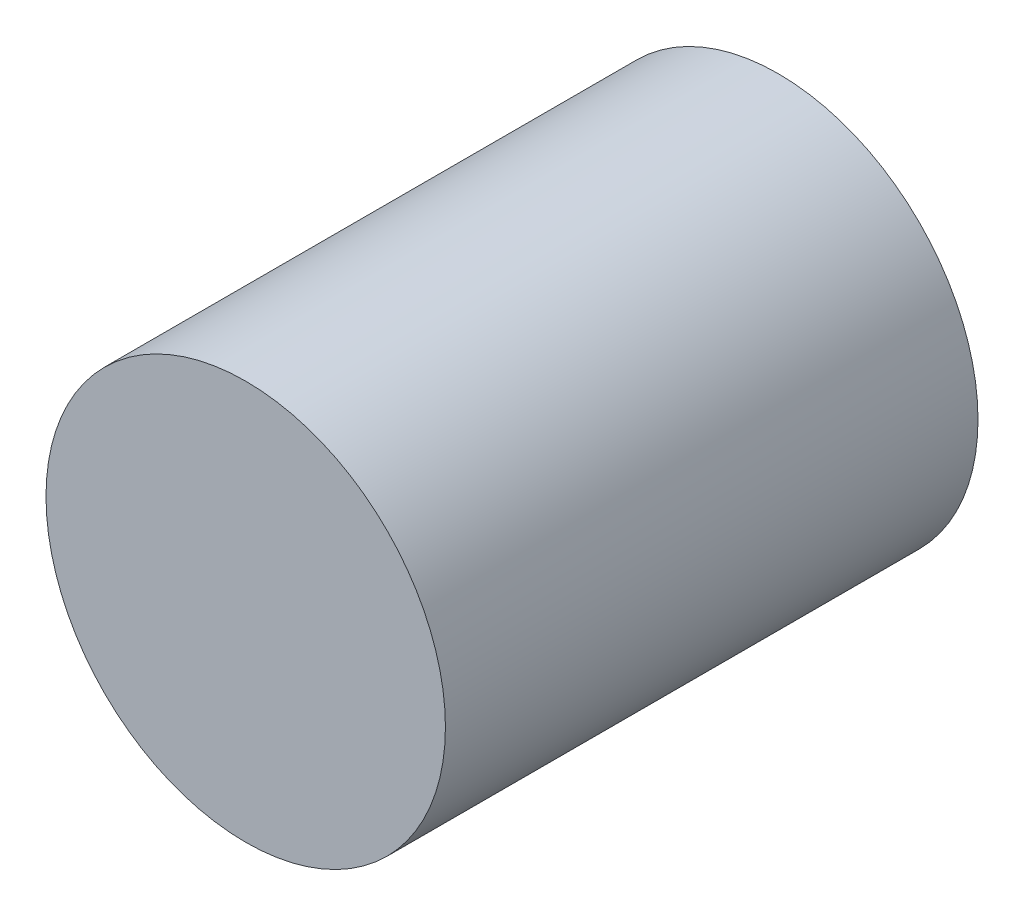
ISO-10303-21;
HEADER;
FILE_DESCRIPTION(('STEP AP214'),'2;1');
FILE_NAME('part.step','',(''),(''),'','','');
FILE_SCHEMA(('AUTOMOTIVE_DESIGN { 1 0 10303 214 1 1 1 1 }'));
ENDSEC;
DATA;
#1=APPLICATION_CONTEXT('core data for automotive mechanical design processes');
#2=APPLICATION_PROTOCOL_DEFINITION('international standard','automotive_design',2000,#1);
#3=PRODUCT_CONTEXT('',#1,'mechanical');
#4=PRODUCT('Part','Part','',(#3));
#5=PRODUCT_RELATED_PRODUCT_CATEGORY('part','',(#4));
#6=PRODUCT_DEFINITION_FORMATION('','',#4);
#7=PRODUCT_DEFINITION_CONTEXT('part definition',#1,'design');
#8=PRODUCT_DEFINITION('design','',#6,#7);
#9=PRODUCT_DEFINITION_SHAPE('','',#8);
#10=(LENGTH_UNIT() NAMED_UNIT(*) SI_UNIT(.MILLI.,.METRE.));
#11=(NAMED_UNIT(*) PLANE_ANGLE_UNIT() SI_UNIT($,.RADIAN.));
#12=(NAMED_UNIT(*) SI_UNIT($,.STERADIAN.) SOLID_ANGLE_UNIT());
#13=UNCERTAINTY_MEASURE_WITH_UNIT(LENGTH_MEASURE(1.E-05),#10,'distance_accuracy_value','');
#14=(GEOMETRIC_REPRESENTATION_CONTEXT(3) GLOBAL_UNCERTAINTY_ASSIGNED_CONTEXT((#13)) GLOBAL_UNIT_ASSIGNED_CONTEXT((#10,
#11,#12)) REPRESENTATION_CONTEXT('',''));
#15=CARTESIAN_POINT('',(0.,0.,0.));
#16=DIRECTION('',(0.,0.,1.));
#17=DIRECTION('',(1.,0.,0.));
#18=AXIS2_PLACEMENT_3D('',#15,#16,#17);
#19=CARTESIAN_POINT('',(0.,0.,12.7));
#20=DIRECTION('',(0.,0.,-1.));
#21=DIRECTION('',(-1.,0.,0.));
#22=AXIS2_PLACEMENT_3D('',#19,#20,#21);
#23=CYLINDRICAL_SURFACE('',#22,4.7625);
#24=CARTESIAN_POINT('',(0.,0.,12.7));
#25=DIRECTION('',(0.,0.,1.));
#26=DIRECTION('',(1.,0.,0.));
#27=AXIS2_PLACEMENT_3D('',#24,#25,#26);
#28=CIRCLE('',#27,4.7625);
#29=CARTESIAN_POINT('',(4.7625,0.,12.7));
#30=VERTEX_POINT('',#29);
#31=EDGE_CURVE('E10',#30,#30,#28,.T.);
#32=ORIENTED_EDGE('',*,*,#31,.F.);
#33=EDGE_LOOP('',(#32));
#34=FACE_BOUND('',#33,.T.);
#35=CARTESIAN_POINT('',(0.,0.,0.));
#36=DIRECTION('',(0.,0.,1.));
#37=DIRECTION('',(1.,0.,0.));
#38=AXIS2_PLACEMENT_3D('',#35,#36,#37);
#39=CIRCLE('',#38,4.7625);
#40=CARTESIAN_POINT('',(4.7625,0.,0.));
#41=VERTEX_POINT('',#40);
#42=EDGE_CURVE('E40',#41,#41,#39,.T.);
#43=ORIENTED_EDGE('',*,*,#42,.T.);
#44=EDGE_LOOP('',(#43));
#45=FACE_BOUND('',#44,.T.);
#46=ADVANCED_FACE('F34',(#34,#45),#23,.T.);
#47=CARTESIAN_POINT('',(0.,0.,12.7));
#48=DIRECTION('',(0.,0.,1.));
#49=DIRECTION('',(1.,0.,0.));
#50=AXIS2_PLACEMENT_3D('',#47,#48,#49);
#51=PLANE('',#50);
#52=ORIENTED_EDGE('',*,*,#31,.T.);
#53=EDGE_LOOP('',(#52));
#54=FACE_BOUND('',#53,.T.);
#55=ADVANCED_FACE('F49',(#54),#51,.T.);
#56=CARTESIAN_POINT('',(0.,0.,0.));
#57=DIRECTION('',(0.,0.,1.));
#58=DIRECTION('',(1.,0.,0.));
#59=AXIS2_PLACEMENT_3D('',#56,#57,#58);
#60=PLANE('',#59);
#61=ORIENTED_EDGE('',*,*,#42,.F.);
#62=EDGE_LOOP('',(#61));
#63=FACE_BOUND('',#62,.T.);
#64=ADVANCED_FACE('F47',(#63),#60,.F.);
#65=CLOSED_SHELL('',(#46,#55,#64));
#66=MANIFOLD_SOLID_BREP('B2',#65);
#67=ADVANCED_BREP_SHAPE_REPRESENTATION('',(#18,#66),#14);
#68=SHAPE_DEFINITION_REPRESENTATION(#9,#67);
ENDSEC;
END-ISO-10303-21;
